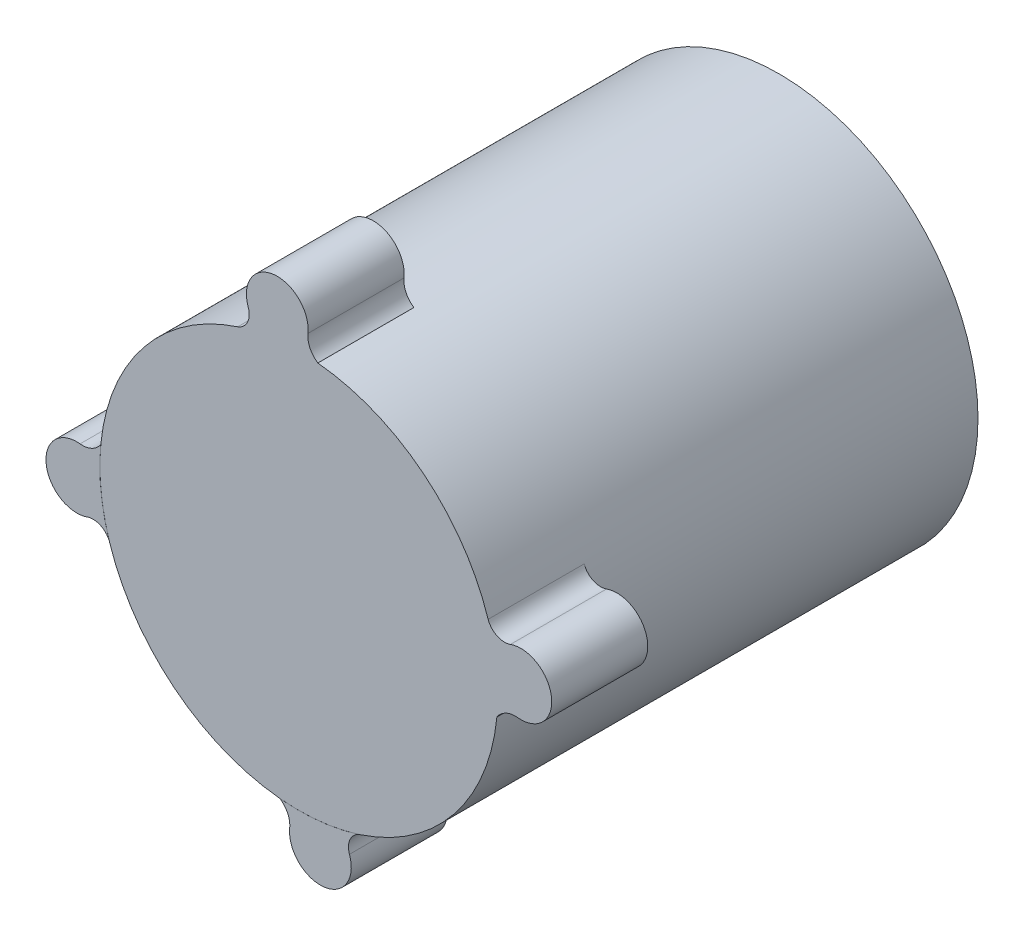
ISO-10303-21;
HEADER;
FILE_DESCRIPTION(('STEP AP214'),'2;1');
FILE_NAME('part.step','',(''),(''),'','','');
FILE_SCHEMA(('AUTOMOTIVE_DESIGN { 1 0 10303 214 1 1 1 1 }'));
ENDSEC;
DATA;
#1=APPLICATION_CONTEXT('core data for automotive mechanical design processes');
#2=APPLICATION_PROTOCOL_DEFINITION('international standard','automotive_design',2000,#1);
#3=PRODUCT_CONTEXT('',#1,'mechanical');
#4=PRODUCT('Part','Part','',(#3));
#5=PRODUCT_RELATED_PRODUCT_CATEGORY('part','',(#4));
#6=PRODUCT_DEFINITION_FORMATION('','',#4);
#7=PRODUCT_DEFINITION_CONTEXT('part definition',#1,'design');
#8=PRODUCT_DEFINITION('design','',#6,#7);
#9=PRODUCT_DEFINITION_SHAPE('','',#8);
#10=(LENGTH_UNIT() NAMED_UNIT(*) SI_UNIT(.MILLI.,.METRE.));
#11=(NAMED_UNIT(*) PLANE_ANGLE_UNIT() SI_UNIT($,.RADIAN.));
#12=(NAMED_UNIT(*) SI_UNIT($,.STERADIAN.) SOLID_ANGLE_UNIT());
#13=UNCERTAINTY_MEASURE_WITH_UNIT(LENGTH_MEASURE(1.E-05),#10,'distance_accuracy_value','');
#14=(GEOMETRIC_REPRESENTATION_CONTEXT(3) GLOBAL_UNCERTAINTY_ASSIGNED_CONTEXT((#13)) GLOBAL_UNIT_ASSIGNED_CONTEXT((#10,
#11,#12)) REPRESENTATION_CONTEXT('',''));
#15=CARTESIAN_POINT('',(0.,0.,0.));
#16=DIRECTION('',(0.,0.,1.));
#17=DIRECTION('',(1.,0.,0.));
#18=AXIS2_PLACEMENT_3D('',#15,#16,#17);
#19=CARTESIAN_POINT('',(-32.3631624940264,-3.14318675037455,56.));
#20=DIRECTION('',(0.,0.,1.));
#21=DIRECTION('',(1.,0.,0.));
#22=AXIS2_PLACEMENT_3D('',#19,#20,#21);
#23=CYLINDRICAL_SURFACE('',#22,4.49999999999999);
#24=CARTESIAN_POINT('',(-32.3631624940264,-3.14318675037455,70.));
#25=DIRECTION('',(0.,0.,1.));
#26=DIRECTION('',(1.,0.,0.));
#27=AXIS2_PLACEMENT_3D('',#24,#25,#26);
#28=CIRCLE('',#27,4.49999999999999);
#29=CARTESIAN_POINT('',(-31.8881218543479,1.33166926861129,70.));
#30=VERTEX_POINT('',#29);
#31=CARTESIAN_POINT('',(-30.8479037398254,-7.38040174466231,70.));
#32=VERTEX_POINT('',#31);
#33=EDGE_CURVE('E112',#30,#32,#28,.T.);
#34=ORIENTED_EDGE('',*,*,#33,.F.);
#35=DIRECTION('',(0.,0.,1.));
#36=VECTOR('',#35,1.);
#37=CARTESIAN_POINT('',(-31.8881218543479,1.33166926861129,56.));
#38=LINE('',#37,#36);
#39=CARTESIAN_POINT('',(-31.8881218543479,1.33166926861129,56.));
#40=VERTEX_POINT('',#39);
#41=EDGE_CURVE('E12',#40,#30,#38,.T.);
#42=ORIENTED_EDGE('',*,*,#41,.F.);
#43=CARTESIAN_POINT('',(-32.3631624940264,-3.14318675037455,56.));
#44=DIRECTION('',(0.,0.,1.));
#45=DIRECTION('',(1.,0.,0.));
#46=AXIS2_PLACEMENT_3D('',#43,#44,#45);
#47=CIRCLE('',#46,4.49999999999999);
#48=CARTESIAN_POINT('',(-30.8479037398254,-7.38040174466231,56.));
#49=VERTEX_POINT('',#48);
#50=EDGE_CURVE('E107',#40,#49,#47,.T.);
#51=ORIENTED_EDGE('',*,*,#50,.T.);
#52=DIRECTION('',(0.,0.,1.));
#53=VECTOR('',#52,1.);
#54=CARTESIAN_POINT('',(-30.8479037398254,-7.38040174466231,56.));
#55=LINE('',#54,#53);
#56=EDGE_CURVE('E50',#49,#32,#55,.T.);
#57=ORIENTED_EDGE('',*,*,#56,.T.);
#58=EDGE_LOOP('',(#34,#42,#51,#57));
#59=FACE_BOUND('',#58,.T.);
#60=ADVANCED_FACE('F47',(#59),#23,.T.);
#61=CARTESIAN_POINT('',(-31.5503735262406,4.51323946007231,56.));
#62=DIRECTION('',(0.,0.,1.));
#63=DIRECTION('',(1.,0.,0.));
#64=AXIS2_PLACEMENT_3D('',#61,#62,#63);
#65=CYLINDRICAL_SURFACE('',#64,3.1994472673155);
#66=CARTESIAN_POINT('',(-31.5503735262406,4.51323946007231,70.));
#67=DIRECTION('',(0.,0.,1.));
#68=DIRECTION('',(1.,0.,0.));
#69=AXIS2_PLACEMENT_3D('',#66,#67,#68);
#70=CIRCLE('',#69,3.1994472673155);
#71=CARTESIAN_POINT('',(-28.8770943916648,2.75538807699866,70.));
#72=VERTEX_POINT('',#71);
#73=EDGE_CURVE('E80',#30,#72,#70,.T.);
#74=ORIENTED_EDGE('',*,*,#73,.T.);
#75=DIRECTION('',(0.,0.,1.));
#76=VECTOR('',#75,1.);
#77=CARTESIAN_POINT('',(-28.8770943916648,2.75538807699866,56.));
#78=LINE('',#77,#76);
#79=CARTESIAN_POINT('',(-28.8770943916648,2.75538807699866,56.));
#80=VERTEX_POINT('',#79);
#81=EDGE_CURVE('E56',#80,#72,#78,.T.);
#82=ORIENTED_EDGE('',*,*,#81,.F.);
#83=CARTESIAN_POINT('',(-31.5503735262406,4.51323946007231,56.));
#84=DIRECTION('',(0.,0.,1.));
#85=DIRECTION('',(1.,0.,0.));
#86=AXIS2_PLACEMENT_3D('',#83,#84,#85);
#87=CIRCLE('',#86,3.1994472673155);
#88=EDGE_CURVE('E97',#40,#80,#87,.T.);
#89=ORIENTED_EDGE('',*,*,#88,.F.);
#90=ORIENTED_EDGE('',*,*,#41,.T.);
#91=EDGE_LOOP('',(#74,#82,#89,#90));
#92=FACE_BOUND('',#91,.T.);
#93=ADVANCED_FACE('F122',(#92),#65,.F.);
#94=CARTESIAN_POINT('',(-0.00666070377959306,-0.00550032543737783,56.));
#95=DIRECTION('',(0.,0.,1.));
#96=DIRECTION('',(1.,0.,0.));
#97=AXIS2_PLACEMENT_3D('',#94,#95,#96);
#98=CYLINDRICAL_SURFACE('',#97,29.0021455429987);
#99=CARTESIAN_POINT('',(-0.00666070377959306,-0.00550032543737783,70.));
#100=DIRECTION('',(0.,0.,1.));
#101=DIRECTION('',(1.,0.,0.));
#102=AXIS2_PLACEMENT_3D('',#99,#100,#101);
#103=CIRCLE('',#102,29.0021455429987);
#104=CARTESIAN_POINT('',(-27.6514861589343,-8.77408468389059,70.));
#105=VERTEX_POINT('',#104);
#106=EDGE_CURVE('E104',#72,#105,#103,.T.);
#107=ORIENTED_EDGE('',*,*,#106,.T.);
#108=DIRECTION('',(0.,0.,1.));
#109=VECTOR('',#108,1.);
#110=CARTESIAN_POINT('',(-27.6514861589343,-8.77408468389059,56.));
#111=LINE('',#110,#109);
#112=CARTESIAN_POINT('',(-27.6514861589343,-8.77408468389059,56.));
#113=VERTEX_POINT('',#112);
#114=EDGE_CURVE('E101',#113,#105,#111,.T.);
#115=ORIENTED_EDGE('',*,*,#114,.F.);
#116=CARTESIAN_POINT('',(-0.00666070377959306,-0.00550032543737783,56.));
#117=DIRECTION('',(0.,0.,1.));
#118=DIRECTION('',(1.,0.,0.));
#119=AXIS2_PLACEMENT_3D('',#116,#117,#118);
#120=CIRCLE('',#119,29.0021455429987);
#121=EDGE_CURVE('E92',#80,#113,#120,.T.);
#122=ORIENTED_EDGE('',*,*,#121,.F.);
#123=ORIENTED_EDGE('',*,*,#81,.T.);
#124=EDGE_LOOP('',(#107,#115,#122,#123));
#125=FACE_BOUND('',#124,.T.);
#126=ADVANCED_FACE('F102',(#125),#98,.F.);
#127=CARTESIAN_POINT('',(-29.9908402870079,-9.77706310910963,56.));
#128=DIRECTION('',(0.,0.,1.));
#129=DIRECTION('',(1.,0.,0.));
#130=AXIS2_PLACEMENT_3D('',#127,#128,#129);
#131=CYLINDRICAL_SURFACE('',#130,2.54529830432305);
#132=CARTESIAN_POINT('',(-29.9908402870079,-9.77706310910963,70.));
#133=DIRECTION('',(0.,0.,1.));
#134=DIRECTION('',(1.,0.,0.));
#135=AXIS2_PLACEMENT_3D('',#132,#133,#134);
#136=CIRCLE('',#135,2.54529830432305);
#137=EDGE_CURVE('E115',#32,#105,#136,.F.);
#138=ORIENTED_EDGE('',*,*,#137,.F.);
#139=ORIENTED_EDGE('',*,*,#56,.F.);
#140=CARTESIAN_POINT('',(-29.9908402870079,-9.77706310910963,56.));
#141=DIRECTION('',(0.,0.,1.));
#142=DIRECTION('',(1.,0.,0.));
#143=AXIS2_PLACEMENT_3D('',#140,#141,#142);
#144=CIRCLE('',#143,2.54529830432305);
#145=EDGE_CURVE('E96',#49,#113,#144,.F.);
#146=ORIENTED_EDGE('',*,*,#145,.T.);
#147=ORIENTED_EDGE('',*,*,#114,.T.);
#148=EDGE_LOOP('',(#138,#139,#146,#147));
#149=FACE_BOUND('',#148,.T.);
#150=ADVANCED_FACE('F106',(#149),#131,.F.);
#151=CARTESIAN_POINT('',(0.,0.,56.));
#152=DIRECTION('',(0.,0.,1.));
#153=DIRECTION('',(1.,0.,0.));
#154=AXIS2_PLACEMENT_3D('',#151,#152,#153);
#155=PLANE('',#154);
#156=ORIENTED_EDGE('',*,*,#50,.F.);
#157=ORIENTED_EDGE('',*,*,#88,.T.);
#158=ORIENTED_EDGE('',*,*,#121,.T.);
#159=ORIENTED_EDGE('',*,*,#145,.F.);
#160=EDGE_LOOP('',(#156,#157,#158,#159));
#161=FACE_BOUND('',#160,.T.);
#162=ADVANCED_FACE('F95',(#161),#155,.F.);
#163=CARTESIAN_POINT('',(0.,0.,70.));
#164=DIRECTION('',(0.,0.,1.));
#165=DIRECTION('',(1.,0.,0.));
#166=AXIS2_PLACEMENT_3D('',#163,#164,#165);
#167=PLANE('',#166);
#168=ORIENTED_EDGE('',*,*,#33,.T.);
#169=ORIENTED_EDGE('',*,*,#137,.T.);
#170=ORIENTED_EDGE('',*,*,#106,.F.);
#171=ORIENTED_EDGE('',*,*,#73,.F.);
#172=EDGE_LOOP('',(#168,#169,#170,#171));
#173=FACE_BOUND('',#172,.T.);
#174=ADVANCED_FACE('F120',(#173),#167,.T.);
#175=CLOSED_SHELL('',(#60,#93,#126,#150,#162,#174));
#176=MANIFOLD_SOLID_BREP('B2',#175);
#177=CARTESIAN_POINT('',(3.14318675037461,-32.3631624940261,56.));
#178=DIRECTION('',(0.,0.,1.));
#179=DIRECTION('',(1.,0.,0.));
#180=AXIS2_PLACEMENT_3D('',#177,#178,#179);
#181=CYLINDRICAL_SURFACE('',#180,4.49999999999999);
#182=CARTESIAN_POINT('',(3.14318675037461,-32.3631624940261,70.));
#183=DIRECTION('',(0.,0.,1.));
#184=DIRECTION('',(1.,0.,0.));
#185=AXIS2_PLACEMENT_3D('',#182,#183,#184);
#186=CIRCLE('',#185,4.49999999999999);
#187=CARTESIAN_POINT('',(-1.33166926861123,-31.8881218543476,70.));
#188=VERTEX_POINT('',#187);
#189=CARTESIAN_POINT('',(7.38040174466237,-30.847903739825,70.));
#190=VERTEX_POINT('',#189);
#191=EDGE_CURVE('E244',#188,#190,#186,.T.);
#192=ORIENTED_EDGE('',*,*,#191,.F.);
#193=DIRECTION('',(0.,0.,1.));
#194=VECTOR('',#193,1.);
#195=CARTESIAN_POINT('',(-1.33166926861123,-31.8881218543476,56.));
#196=LINE('',#195,#194);
#197=CARTESIAN_POINT('',(-1.33166926861123,-31.8881218543476,56.));
#198=VERTEX_POINT('',#197);
#199=EDGE_CURVE('E45',#198,#188,#196,.T.);
#200=ORIENTED_EDGE('',*,*,#199,.F.);
#201=CARTESIAN_POINT('',(3.14318675037461,-32.3631624940261,56.));
#202=DIRECTION('',(0.,0.,1.));
#203=DIRECTION('',(1.,0.,0.));
#204=AXIS2_PLACEMENT_3D('',#201,#202,#203);
#205=CIRCLE('',#204,4.49999999999999);
#206=CARTESIAN_POINT('',(7.38040174466237,-30.847903739825,56.));
#207=VERTEX_POINT('',#206);
#208=EDGE_CURVE('E239',#198,#207,#205,.T.);
#209=ORIENTED_EDGE('',*,*,#208,.T.);
#210=DIRECTION('',(0.,0.,1.));
#211=VECTOR('',#210,1.);
#212=CARTESIAN_POINT('',(7.38040174466237,-30.847903739825,56.));
#213=LINE('',#212,#211);
#214=EDGE_CURVE('E182',#207,#190,#213,.T.);
#215=ORIENTED_EDGE('',*,*,#214,.T.);
#216=EDGE_LOOP('',(#192,#200,#209,#215));
#217=FACE_BOUND('',#216,.T.);
#218=ADVANCED_FACE('F179',(#217),#181,.T.);
#219=CARTESIAN_POINT('',(-4.51323946007221,-31.5503735262406,56.));
#220=DIRECTION('',(0.,0.,1.));
#221=DIRECTION('',(1.,0.,0.));
#222=AXIS2_PLACEMENT_3D('',#219,#220,#221);
#223=CYLINDRICAL_SURFACE('',#222,3.19944726731559);
#224=CARTESIAN_POINT('',(-4.51323946007221,-31.5503735262406,70.));
#225=DIRECTION('',(0.,0.,1.));
#226=DIRECTION('',(1.,0.,0.));
#227=AXIS2_PLACEMENT_3D('',#224,#225,#226);
#228=CIRCLE('',#227,3.19944726731559);
#229=CARTESIAN_POINT('',(-2.75538807699889,-28.8770943916644,70.));
#230=VERTEX_POINT('',#229);
#231=EDGE_CURVE('E212',#188,#230,#228,.T.);
#232=ORIENTED_EDGE('',*,*,#231,.T.);
#233=DIRECTION('',(0.,0.,1.));
#234=VECTOR('',#233,1.);
#235=CARTESIAN_POINT('',(-2.75538807699889,-28.8770943916644,56.));
#236=LINE('',#235,#234);
#237=CARTESIAN_POINT('',(-2.75538807699889,-28.8770943916644,56.));
#238=VERTEX_POINT('',#237);
#239=EDGE_CURVE('E188',#238,#230,#236,.T.);
#240=ORIENTED_EDGE('',*,*,#239,.F.);
#241=CARTESIAN_POINT('',(-4.51323946007221,-31.5503735262406,56.));
#242=DIRECTION('',(0.,0.,1.));
#243=DIRECTION('',(1.,0.,0.));
#244=AXIS2_PLACEMENT_3D('',#241,#242,#243);
#245=CIRCLE('',#244,3.19944726731559);
#246=EDGE_CURVE('E229',#198,#238,#245,.T.);
#247=ORIENTED_EDGE('',*,*,#246,.F.);
#248=ORIENTED_EDGE('',*,*,#199,.T.);
#249=EDGE_LOOP('',(#232,#240,#247,#248));
#250=FACE_BOUND('',#249,.T.);
#251=ADVANCED_FACE('F254',(#250),#223,.F.);
#252=CARTESIAN_POINT('',(-0.00666070377959306,-0.00550032543737783,56.));
#253=DIRECTION('',(0.,0.,1.));
#254=DIRECTION('',(1.,0.,0.));
#255=AXIS2_PLACEMENT_3D('',#252,#253,#254);
#256=CYLINDRICAL_SURFACE('',#255,29.0021455429987);
#257=CARTESIAN_POINT('',(-0.00666070377959306,-0.00550032543737783,70.));
#258=DIRECTION('',(0.,0.,1.));
#259=DIRECTION('',(1.,0.,0.));
#260=AXIS2_PLACEMENT_3D('',#257,#258,#259);
#261=CIRCLE('',#260,29.0021455429987);
#262=CARTESIAN_POINT('',(8.82580425739551,-27.6299823804352,70.));
#263=VERTEX_POINT('',#262);
#264=EDGE_CURVE('E236',#230,#263,#261,.T.);
#265=ORIENTED_EDGE('',*,*,#264,.T.);
#266=DIRECTION('',(0.,0.,1.));
#267=VECTOR('',#266,1.);
#268=CARTESIAN_POINT('',(8.82580425739551,-27.6299823804352,56.));
#269=LINE('',#268,#267);
#270=CARTESIAN_POINT('',(8.82580425739551,-27.6299823804352,56.));
#271=VERTEX_POINT('',#270);
#272=EDGE_CURVE('E233',#271,#263,#269,.T.);
#273=ORIENTED_EDGE('',*,*,#272,.F.);
#274=CARTESIAN_POINT('',(-0.00666070377959306,-0.00550032543737783,56.));
#275=DIRECTION('',(0.,0.,1.));
#276=DIRECTION('',(1.,0.,0.));
#277=AXIS2_PLACEMENT_3D('',#274,#275,#276);
#278=CIRCLE('',#277,29.0021455429987);
#279=EDGE_CURVE('E224',#238,#271,#278,.T.);
#280=ORIENTED_EDGE('',*,*,#279,.F.);
#281=ORIENTED_EDGE('',*,*,#239,.T.);
#282=EDGE_LOOP('',(#265,#273,#280,#281));
#283=FACE_BOUND('',#282,.T.);
#284=ADVANCED_FACE('F234',(#283),#256,.F.);
#285=CARTESIAN_POINT('',(9.7770631091097,-29.9908402870076,56.));
#286=DIRECTION('',(0.,0.,1.));
#287=DIRECTION('',(1.,0.,0.));
#288=AXIS2_PLACEMENT_3D('',#285,#286,#287);
#289=CYLINDRICAL_SURFACE('',#288,2.54529830432308);
#290=CARTESIAN_POINT('',(9.7770631091097,-29.9908402870076,70.));
#291=DIRECTION('',(0.,0.,1.));
#292=DIRECTION('',(1.,0.,0.));
#293=AXIS2_PLACEMENT_3D('',#290,#291,#292);
#294=CIRCLE('',#293,2.54529830432308);
#295=EDGE_CURVE('E247',#190,#263,#294,.F.);
#296=ORIENTED_EDGE('',*,*,#295,.F.);
#297=ORIENTED_EDGE('',*,*,#214,.F.);
#298=CARTESIAN_POINT('',(9.7770631091097,-29.9908402870076,56.));
#299=DIRECTION('',(0.,0.,1.));
#300=DIRECTION('',(1.,0.,0.));
#301=AXIS2_PLACEMENT_3D('',#298,#299,#300);
#302=CIRCLE('',#301,2.54529830432308);
#303=EDGE_CURVE('E228',#207,#271,#302,.F.);
#304=ORIENTED_EDGE('',*,*,#303,.T.);
#305=ORIENTED_EDGE('',*,*,#272,.T.);
#306=EDGE_LOOP('',(#296,#297,#304,#305));
#307=FACE_BOUND('',#306,.T.);
#308=ADVANCED_FACE('F238',(#307),#289,.F.);
#309=CARTESIAN_POINT('',(0.,0.,56.));
#310=DIRECTION('',(0.,0.,1.));
#311=DIRECTION('',(1.,0.,0.));
#312=AXIS2_PLACEMENT_3D('',#309,#310,#311);
#313=PLANE('',#312);
#314=ORIENTED_EDGE('',*,*,#208,.F.);
#315=ORIENTED_EDGE('',*,*,#246,.T.);
#316=ORIENTED_EDGE('',*,*,#279,.T.);
#317=ORIENTED_EDGE('',*,*,#303,.F.);
#318=EDGE_LOOP('',(#314,#315,#316,#317));
#319=FACE_BOUND('',#318,.T.);
#320=ADVANCED_FACE('F227',(#319),#313,.F.);
#321=CARTESIAN_POINT('',(0.,0.,70.));
#322=DIRECTION('',(0.,0.,1.));
#323=DIRECTION('',(1.,0.,0.));
#324=AXIS2_PLACEMENT_3D('',#321,#322,#323);
#325=PLANE('',#324);
#326=ORIENTED_EDGE('',*,*,#191,.T.);
#327=ORIENTED_EDGE('',*,*,#295,.T.);
#328=ORIENTED_EDGE('',*,*,#264,.F.);
#329=ORIENTED_EDGE('',*,*,#231,.F.);
#330=EDGE_LOOP('',(#326,#327,#328,#329));
#331=FACE_BOUND('',#330,.T.);
#332=ADVANCED_FACE('F252',(#331),#325,.T.);
#333=CLOSED_SHELL('',(#218,#251,#284,#308,#320,#332));
#334=MANIFOLD_SOLID_BREP('B6',#333);
#335=CARTESIAN_POINT('',(0.,0.,70.));
#336=DIRECTION('',(0.,0.,-1.));
#337=DIRECTION('',(-1.,0.,0.));
#338=AXIS2_PLACEMENT_3D('',#335,#336,#337);
#339=CYLINDRICAL_SURFACE('',#338,29.);
#340=CARTESIAN_POINT('',(0.,0.,0.));
#341=DIRECTION('',(0.,0.,1.));
#342=DIRECTION('',(1.,0.,0.));
#343=AXIS2_PLACEMENT_3D('',#340,#341,#342);
#344=CIRCLE('',#343,29.);
#345=CARTESIAN_POINT('',(29.,0.,0.));
#346=VERTEX_POINT('',#345);
#347=EDGE_CURVE('E305',#346,#346,#344,.T.);
#348=ORIENTED_EDGE('',*,*,#347,.T.);
#349=EDGE_LOOP('',(#348));
#350=FACE_BOUND('',#349,.T.);
#351=DIRECTION('',(0.,0.,1.));
#352=VECTOR('',#351,1.);
#353=CARTESIAN_POINT('',(2.77014356415467,28.8673917185805,56.));
#354=LINE('',#353,#352);
#355=CARTESIAN_POINT('',(2.77014356415467,28.8673917185805,56.));
#356=VERTEX_POINT('',#355);
#357=CARTESIAN_POINT('',(2.77014356415467,28.8673917185805,70.));
#358=VERTEX_POINT('',#357);
#359=EDGE_CURVE('E418',#356,#358,#354,.T.);
#360=ORIENTED_EDGE('',*,*,#359,.T.);
#361=CARTESIAN_POINT('',(0.,0.,70.));
#362=DIRECTION('',(0.,0.,1.));
#363=DIRECTION('',(1.,0.,0.));
#364=AXIS2_PLACEMENT_3D('',#361,#362,#363);
#365=CIRCLE('',#364,29.);
#366=CARTESIAN_POINT('',(27.593197744034,8.92274835791302,70.));
#367=VERTEX_POINT('',#366);
#368=EDGE_CURVE('E177',#367,#358,#365,.T.);
#369=ORIENTED_EDGE('',*,*,#368,.F.);
#370=DIRECTION('',(0.,0.,1.));
#371=VECTOR('',#370,1.);
#372=CARTESIAN_POINT('',(27.593197744034,8.92274835791302,56.));
#373=LINE('',#372,#371);
#374=CARTESIAN_POINT('',(27.593197744034,8.92274835791302,56.));
#375=VERTEX_POINT('',#374);
#376=EDGE_CURVE('E452',#375,#367,#373,.T.);
#377=ORIENTED_EDGE('',*,*,#376,.F.);
#378=CARTESIAN_POINT('',(0.,0.,56.));
#379=DIRECTION('',(0.,0.,1.));
#380=DIRECTION('',(1.,0.,0.));
#381=AXIS2_PLACEMENT_3D('',#378,#379,#380);
#382=CIRCLE('',#381,29.);
#383=CARTESIAN_POINT('',(28.8645351825138,-2.79975154208778,56.));
#384=VERTEX_POINT('',#383);
#385=EDGE_CURVE('E431',#384,#375,#382,.T.);
#386=ORIENTED_EDGE('',*,*,#385,.F.);
#387=DIRECTION('',(0.,0.,1.));
#388=VECTOR('',#387,1.);
#389=CARTESIAN_POINT('',(28.8645351825138,-2.79975154208778,56.));
#390=LINE('',#389,#388);
#391=CARTESIAN_POINT('',(28.8645351825138,-2.79975154208778,70.));
#392=VERTEX_POINT('',#391);
#393=EDGE_CURVE('E449',#384,#392,#390,.T.);
#394=ORIENTED_EDGE('',*,*,#393,.T.);
#395=CARTESIAN_POINT('',(-8.92274835792259,27.5931977440309,70.));
#396=VERTEX_POINT('',#395);
#397=EDGE_CURVE('E310',#396,#392,#365,.T.);
#398=ORIENTED_EDGE('',*,*,#397,.F.);
#399=DIRECTION('',(0.,0.,1.));
#400=VECTOR('',#399,1.);
#401=CARTESIAN_POINT('',(-8.92274835792259,27.5931977440309,56.));
#402=LINE('',#401,#400);
#403=CARTESIAN_POINT('',(-8.92274835792259,27.5931977440309,56.));
#404=VERTEX_POINT('',#403);
#405=EDGE_CURVE('E421',#404,#396,#402,.T.);
#406=ORIENTED_EDGE('',*,*,#405,.F.);
#407=CARTESIAN_POINT('',(0.,0.,56.));
#408=DIRECTION('',(0.,0.,1.));
#409=DIRECTION('',(1.,0.,0.));
#410=AXIS2_PLACEMENT_3D('',#407,#408,#409);
#411=CIRCLE('',#410,29.);
#412=EDGE_CURVE('E406',#356,#404,#411,.T.);
#413=ORIENTED_EDGE('',*,*,#412,.F.);
#414=EDGE_LOOP('',(#360,#369,#377,#386,#394,#398,#406,#413));
#415=FACE_BOUND('',#414,.T.);
#416=ADVANCED_FACE('F302',(#350,#415),#339,.T.);
#417=CARTESIAN_POINT('',(0.,0.,70.));
#418=DIRECTION('',(0.,0.,1.));
#419=DIRECTION('',(1.,0.,0.));
#420=AXIS2_PLACEMENT_3D('',#417,#418,#419);
#421=PLANE('',#420);
#422=ORIENTED_EDGE('',*,*,#368,.T.);
#423=DIRECTION('',(0.835544052213261,-0.549423458555461,0.));
#424=VECTOR('',#423,1.);
#425=CARTESIAN_POINT('',(14.0882939688338,21.4249865894701,70.));
#426=LINE('',#425,#424);
#427=CARTESIAN_POINT('',(2.75538807699826,28.8770943916648,70.));
#428=VERTEX_POINT('',#427);
#429=EDGE_CURVE('E399',#428,#358,#426,.T.);
#430=ORIENTED_EDGE('',*,*,#429,.F.);
#431=CARTESIAN_POINT('',(4.51323946007198,31.5503735262406,70.));
#432=DIRECTION('',(0.,0.,1.));
#433=DIRECTION('',(1.,0.,0.));
#434=AXIS2_PLACEMENT_3D('',#431,#432,#433);
#435=CIRCLE('',#434,3.1994472673155);
#436=CARTESIAN_POINT('',(1.33166926861096,31.888121854348,70.));
#437=VERTEX_POINT('',#436);
#438=EDGE_CURVE('E411',#437,#428,#435,.T.);
#439=ORIENTED_EDGE('',*,*,#438,.F.);
#440=CARTESIAN_POINT('',(-3.14318675037488,32.3631624940265,70.));
#441=DIRECTION('',(0.,0.,1.));
#442=DIRECTION('',(1.,0.,0.));
#443=AXIS2_PLACEMENT_3D('',#440,#441,#442);
#444=CIRCLE('',#443,4.49999999999999);
#445=CARTESIAN_POINT('',(-7.38040174466264,30.8479037398254,70.));
#446=VERTEX_POINT('',#445);
#447=EDGE_CURVE('E385',#437,#446,#444,.T.);
#448=ORIENTED_EDGE('',*,*,#447,.T.);
#449=CARTESIAN_POINT('',(-9.77706310910997,29.990840287008,70.));
#450=DIRECTION('',(0.,0.,1.));
#451=DIRECTION('',(1.,0.,0.));
#452=AXIS2_PLACEMENT_3D('',#449,#450,#451);
#453=CIRCLE('',#452,2.54529830432308);
#454=EDGE_CURVE('E317',#446,#396,#453,.F.);
#455=ORIENTED_EDGE('',*,*,#454,.T.);
#456=ORIENTED_EDGE('',*,*,#397,.T.);
#457=DIRECTION('',(-0.272392976648777,-0.962186087133055,0.));
#458=VECTOR('',#457,1.);
#459=CARTESIAN_POINT('',(27.4566408455709,-7.77292067378151,70.));
#460=LINE('',#459,#458);
#461=CARTESIAN_POINT('',(28.8770943916645,-2.7553880769982,70.));
#462=VERTEX_POINT('',#461);
#463=EDGE_CURVE('E440',#462,#392,#460,.T.);
#464=ORIENTED_EDGE('',*,*,#463,.F.);
#465=CARTESIAN_POINT('',(31.5503735262406,-4.51323946007209,70.));
#466=DIRECTION('',(0.,0.,1.));
#467=DIRECTION('',(1.,0.,0.));
#468=AXIS2_PLACEMENT_3D('',#465,#466,#467);
#469=CIRCLE('',#468,3.19944726731574);
#470=CARTESIAN_POINT('',(31.8881218543477,-1.33166926861091,70.));
#471=VERTEX_POINT('',#470);
#472=EDGE_CURVE('E428',#471,#462,#469,.T.);
#473=ORIENTED_EDGE('',*,*,#472,.F.);
#474=CARTESIAN_POINT('',(32.3631624940261,3.14318675037494,70.));
#475=DIRECTION('',(0.,0.,1.));
#476=DIRECTION('',(1.,0.,0.));
#477=AXIS2_PLACEMENT_3D('',#474,#475,#476);
#478=CIRCLE('',#477,4.49999999999999);
#479=CARTESIAN_POINT('',(30.8479037398251,7.3804017446627,70.));
#480=VERTEX_POINT('',#479);
#481=EDGE_CURVE('E417',#471,#480,#478,.T.);
#482=ORIENTED_EDGE('',*,*,#481,.T.);
#483=CARTESIAN_POINT('',(29.9908402870076,9.77706310911002,70.));
#484=DIRECTION('',(0.,0.,1.));
#485=DIRECTION('',(1.,0.,0.));
#486=AXIS2_PLACEMENT_3D('',#483,#484,#485);
#487=CIRCLE('',#486,2.54529830432307);
#488=EDGE_CURVE('E323',#480,#367,#487,.F.);
#489=ORIENTED_EDGE('',*,*,#488,.T.);
#490=EDGE_LOOP('',(#422,#430,#439,#448,#455,#456,#464,#473,#482,#489));
#491=FACE_BOUND('',#490,.T.);
#492=ADVANCED_FACE('F464',(#491),#421,.T.);
#493=CARTESIAN_POINT('',(0.,0.,0.));
#494=DIRECTION('',(0.,0.,1.));
#495=DIRECTION('',(1.,0.,0.));
#496=AXIS2_PLACEMENT_3D('',#493,#494,#495);
#497=PLANE('',#496);
#498=ORIENTED_EDGE('',*,*,#347,.F.);
#499=EDGE_LOOP('',(#498));
#500=FACE_BOUND('',#499,.T.);
#501=ADVANCED_FACE('F490',(#500),#497,.F.);
#502=CARTESIAN_POINT('',(32.3631624940261,3.14318675037494,56.));
#503=DIRECTION('',(0.,0.,1.));
#504=DIRECTION('',(1.,0.,0.));
#505=AXIS2_PLACEMENT_3D('',#502,#503,#504);
#506=CYLINDRICAL_SURFACE('',#505,4.49999999999999);
#507=ORIENTED_EDGE('',*,*,#481,.F.);
#508=DIRECTION('',(0.,0.,1.));
#509=VECTOR('',#508,1.);
#510=CARTESIAN_POINT('',(31.8881218543477,-1.33166926861091,56.));
#511=LINE('',#510,#509);
#512=CARTESIAN_POINT('',(31.8881218543477,-1.33166926861091,56.));
#513=VERTEX_POINT('',#512);
#514=EDGE_CURVE('E444',#513,#471,#511,.T.);
#515=ORIENTED_EDGE('',*,*,#514,.F.);
#516=CARTESIAN_POINT('',(32.3631624940261,3.14318675037494,56.));
#517=DIRECTION('',(0.,0.,1.));
#518=DIRECTION('',(1.,0.,0.));
#519=AXIS2_PLACEMENT_3D('',#516,#517,#518);
#520=CIRCLE('',#519,4.49999999999999);
#521=CARTESIAN_POINT('',(30.8479037398251,7.3804017446627,56.));
#522=VERTEX_POINT('',#521);
#523=EDGE_CURVE('E424',#513,#522,#520,.T.);
#524=ORIENTED_EDGE('',*,*,#523,.T.);
#525=DIRECTION('',(0.,0.,1.));
#526=VECTOR('',#525,1.);
#527=CARTESIAN_POINT('',(30.8479037398251,7.3804017446627,56.));
#528=LINE('',#527,#526);
#529=EDGE_CURVE('E437',#522,#480,#528,.T.);
#530=ORIENTED_EDGE('',*,*,#529,.T.);
#531=EDGE_LOOP('',(#507,#515,#524,#530));
#532=FACE_BOUND('',#531,.T.);
#533=ADVANCED_FACE('F456',(#532),#506,.T.);
#534=CARTESIAN_POINT('',(31.5503735262406,-4.51323946007209,56.));
#535=DIRECTION('',(0.,0.,1.));
#536=DIRECTION('',(1.,0.,0.));
#537=AXIS2_PLACEMENT_3D('',#534,#535,#536);
#538=CYLINDRICAL_SURFACE('',#537,3.19944726731574);
#539=ORIENTED_EDGE('',*,*,#472,.T.);
#540=DIRECTION('',(0.,0.,1.));
#541=VECTOR('',#540,1.);
#542=CARTESIAN_POINT('',(28.8770943916645,-2.7553880769982,56.));
#543=LINE('',#542,#541);
#544=CARTESIAN_POINT('',(28.8770943916645,-2.7553880769982,56.));
#545=VERTEX_POINT('',#544);
#546=EDGE_CURVE('E446',#545,#462,#543,.T.);
#547=ORIENTED_EDGE('',*,*,#546,.F.);
#548=CARTESIAN_POINT('',(31.5503735262406,-4.51323946007209,56.));
#549=DIRECTION('',(0.,0.,1.));
#550=DIRECTION('',(1.,0.,0.));
#551=AXIS2_PLACEMENT_3D('',#548,#549,#550);
#552=CIRCLE('',#551,3.19944726731574);
#553=EDGE_CURVE('E435',#513,#545,#552,.T.);
#554=ORIENTED_EDGE('',*,*,#553,.F.);
#555=ORIENTED_EDGE('',*,*,#514,.T.);
#556=EDGE_LOOP('',(#539,#547,#554,#555));
#557=FACE_BOUND('',#556,.T.);
#558=ADVANCED_FACE('F468',(#557),#538,.F.);
#559=CARTESIAN_POINT('',(27.4566408455709,-7.77292067378151,56.));
#560=DIRECTION('',(-0.962186087133055,0.272392976648777,0.));
#561=DIRECTION('',(-0.272392976648777,-0.962186087133055,0.));
#562=AXIS2_PLACEMENT_3D('',#559,#560,#561);
#563=PLANE('',#562);
#564=ORIENTED_EDGE('',*,*,#463,.T.);
#565=ORIENTED_EDGE('',*,*,#393,.F.);
#566=DIRECTION('',(-0.272392976648777,-0.962186087133055,0.));
#567=VECTOR('',#566,1.);
#568=CARTESIAN_POINT('',(27.4566408455709,-7.77292067378151,56.));
#569=LINE('',#568,#567);
#570=EDGE_CURVE('E433',#545,#384,#569,.T.);
#571=ORIENTED_EDGE('',*,*,#570,.F.);
#572=ORIENTED_EDGE('',*,*,#546,.T.);
#573=EDGE_LOOP('',(#564,#565,#571,#572));
#574=FACE_BOUND('',#573,.T.);
#575=ADVANCED_FACE('F472',(#574),#563,.F.);
#576=CARTESIAN_POINT('',(29.9908402870076,9.77706310911002,56.));
#577=DIRECTION('',(0.,0.,1.));
#578=DIRECTION('',(1.,0.,0.));
#579=AXIS2_PLACEMENT_3D('',#576,#577,#578);
#580=CYLINDRICAL_SURFACE('',#579,2.54529830432307);
#581=ORIENTED_EDGE('',*,*,#488,.F.);
#582=ORIENTED_EDGE('',*,*,#529,.F.);
#583=CARTESIAN_POINT('',(29.9908402870076,9.77706310911002,56.));
#584=DIRECTION('',(0.,0.,1.));
#585=DIRECTION('',(1.,0.,0.));
#586=AXIS2_PLACEMENT_3D('',#583,#584,#585);
#587=CIRCLE('',#586,2.54529830432307);
#588=EDGE_CURVE('E427',#522,#375,#587,.F.);
#589=ORIENTED_EDGE('',*,*,#588,.T.);
#590=ORIENTED_EDGE('',*,*,#376,.T.);
#591=EDGE_LOOP('',(#581,#582,#589,#590));
#592=FACE_BOUND('',#591,.T.);
#593=ADVANCED_FACE('F460',(#592),#580,.F.);
#594=CARTESIAN_POINT('',(0.,0.,56.));
#595=DIRECTION('',(0.,0.,1.));
#596=DIRECTION('',(1.,0.,0.));
#597=AXIS2_PLACEMENT_3D('',#594,#595,#596);
#598=PLANE('',#597);
#599=ORIENTED_EDGE('',*,*,#523,.F.);
#600=ORIENTED_EDGE('',*,*,#553,.T.);
#601=ORIENTED_EDGE('',*,*,#570,.T.);
#602=ORIENTED_EDGE('',*,*,#385,.T.);
#603=ORIENTED_EDGE('',*,*,#588,.F.);
#604=EDGE_LOOP('',(#599,#600,#601,#602,#603));
#605=FACE_BOUND('',#604,.T.);
#606=ADVANCED_FACE('F476',(#605),#598,.F.);
#607=CARTESIAN_POINT('',(4.51323946007198,31.5503735262406,56.));
#608=DIRECTION('',(0.,0.,1.));
#609=DIRECTION('',(1.,0.,0.));
#610=AXIS2_PLACEMENT_3D('',#607,#608,#609);
#611=CYLINDRICAL_SURFACE('',#610,3.1994472673155);
#612=ORIENTED_EDGE('',*,*,#438,.T.);
#613=DIRECTION('',(0.,0.,1.));
#614=VECTOR('',#613,1.);
#615=CARTESIAN_POINT('',(2.75538807699826,28.8770943916648,56.));
#616=LINE('',#615,#614);
#617=CARTESIAN_POINT('',(2.75538807699826,28.8770943916648,56.));
#618=VERTEX_POINT('',#617);
#619=EDGE_CURVE('E397',#618,#428,#616,.T.);
#620=ORIENTED_EDGE('',*,*,#619,.F.);
#621=CARTESIAN_POINT('',(4.51323946007198,31.5503735262406,56.));
#622=DIRECTION('',(0.,0.,1.));
#623=DIRECTION('',(1.,0.,0.));
#624=AXIS2_PLACEMENT_3D('',#621,#622,#623);
#625=CIRCLE('',#624,3.1994472673155);
#626=CARTESIAN_POINT('',(1.33166926861096,31.888121854348,56.));
#627=VERTEX_POINT('',#626);
#628=EDGE_CURVE('E394',#627,#618,#625,.T.);
#629=ORIENTED_EDGE('',*,*,#628,.F.);
#630=DIRECTION('',(0.,0.,1.));
#631=VECTOR('',#630,1.);
#632=CARTESIAN_POINT('',(1.33166926861096,31.888121854348,56.));
#633=LINE('',#632,#631);
#634=EDGE_CURVE('E380',#627,#437,#633,.T.);
#635=ORIENTED_EDGE('',*,*,#634,.T.);
#636=EDGE_LOOP('',(#612,#620,#629,#635));
#637=FACE_BOUND('',#636,.T.);
#638=ADVANCED_FACE('F395',(#637),#611,.F.);
#639=CARTESIAN_POINT('',(14.0882939688338,21.4249865894701,56.));
#640=DIRECTION('',(-0.549423458555461,-0.835544052213261,0.));
#641=DIRECTION('',(0.835544052213261,-0.549423458555461,0.));
#642=AXIS2_PLACEMENT_3D('',#639,#640,#641);
#643=PLANE('',#642);
#644=ORIENTED_EDGE('',*,*,#429,.T.);
#645=ORIENTED_EDGE('',*,*,#359,.F.);
#646=DIRECTION('',(0.835544052213261,-0.549423458555461,0.));
#647=VECTOR('',#646,1.);
#648=CARTESIAN_POINT('',(14.0882939688338,21.4249865894701,56.));
#649=LINE('',#648,#647);
#650=EDGE_CURVE('E390',#618,#356,#649,.T.);
#651=ORIENTED_EDGE('',*,*,#650,.F.);
#652=ORIENTED_EDGE('',*,*,#619,.T.);
#653=EDGE_LOOP('',(#644,#645,#651,#652));
#654=FACE_BOUND('',#653,.T.);
#655=ADVANCED_FACE('F481',(#654),#643,.F.);
#656=CARTESIAN_POINT('',(-9.77706310910997,29.990840287008,56.));
#657=DIRECTION('',(0.,0.,1.));
#658=DIRECTION('',(1.,0.,0.));
#659=AXIS2_PLACEMENT_3D('',#656,#657,#658);
#660=CYLINDRICAL_SURFACE('',#659,2.54529830432308);
#661=ORIENTED_EDGE('',*,*,#454,.F.);
#662=DIRECTION('',(0.,0.,1.));
#663=VECTOR('',#662,1.);
#664=CARTESIAN_POINT('',(-7.38040174466264,30.8479037398254,56.));
#665=LINE('',#664,#663);
#666=CARTESIAN_POINT('',(-7.38040174466264,30.8479037398254,56.));
#667=VERTEX_POINT('',#666);
#668=EDGE_CURVE('E389',#667,#446,#665,.T.);
#669=ORIENTED_EDGE('',*,*,#668,.F.);
#670=CARTESIAN_POINT('',(-9.77706310910997,29.990840287008,56.));
#671=DIRECTION('',(0.,0.,1.));
#672=DIRECTION('',(1.,0.,0.));
#673=AXIS2_PLACEMENT_3D('',#670,#671,#672);
#674=CIRCLE('',#673,2.54529830432308);
#675=EDGE_CURVE('E404',#667,#404,#674,.F.);
#676=ORIENTED_EDGE('',*,*,#675,.T.);
#677=ORIENTED_EDGE('',*,*,#405,.T.);
#678=EDGE_LOOP('',(#661,#669,#676,#677));
#679=FACE_BOUND('',#678,.T.);
#680=ADVANCED_FACE('F484',(#679),#660,.F.);
#681=CARTESIAN_POINT('',(-3.14318675037488,32.3631624940265,56.));
#682=DIRECTION('',(0.,0.,1.));
#683=DIRECTION('',(1.,0.,0.));
#684=AXIS2_PLACEMENT_3D('',#681,#682,#683);
#685=CYLINDRICAL_SURFACE('',#684,4.49999999999999);
#686=ORIENTED_EDGE('',*,*,#447,.F.);
#687=ORIENTED_EDGE('',*,*,#634,.F.);
#688=CARTESIAN_POINT('',(-3.14318675037488,32.3631624940265,56.));
#689=DIRECTION('',(0.,0.,1.));
#690=DIRECTION('',(1.,0.,0.));
#691=AXIS2_PLACEMENT_3D('',#688,#689,#690);
#692=CIRCLE('',#691,4.49999999999999);
#693=EDGE_CURVE('E384',#627,#667,#692,.T.);
#694=ORIENTED_EDGE('',*,*,#693,.T.);
#695=ORIENTED_EDGE('',*,*,#668,.T.);
#696=EDGE_LOOP('',(#686,#687,#694,#695));
#697=FACE_BOUND('',#696,.T.);
#698=ADVANCED_FACE('F382',(#697),#685,.T.);
#699=CARTESIAN_POINT('',(0.,0.,56.));
#700=DIRECTION('',(0.,0.,1.));
#701=DIRECTION('',(1.,0.,0.));
#702=AXIS2_PLACEMENT_3D('',#699,#700,#701);
#703=PLANE('',#702);
#704=ORIENTED_EDGE('',*,*,#628,.T.);
#705=ORIENTED_EDGE('',*,*,#650,.T.);
#706=ORIENTED_EDGE('',*,*,#412,.T.);
#707=ORIENTED_EDGE('',*,*,#675,.F.);
#708=ORIENTED_EDGE('',*,*,#693,.F.);
#709=EDGE_LOOP('',(#704,#705,#706,#707,#708));
#710=FACE_BOUND('',#709,.T.);
#711=ADVANCED_FACE('F402',(#710),#703,.F.);
#712=CLOSED_SHELL('',(#416,#492,#501,#533,#558,#575,#593,#606,#638,#655,#680,#698,#711));
#713=MANIFOLD_SOLID_BREP('B39',#712);
#714=ADVANCED_BREP_SHAPE_REPRESENTATION('',(#18,#176,#334,#713),#14);
#715=SHAPE_DEFINITION_REPRESENTATION(#9,#714);
ENDSEC;
END-ISO-10303-21;
